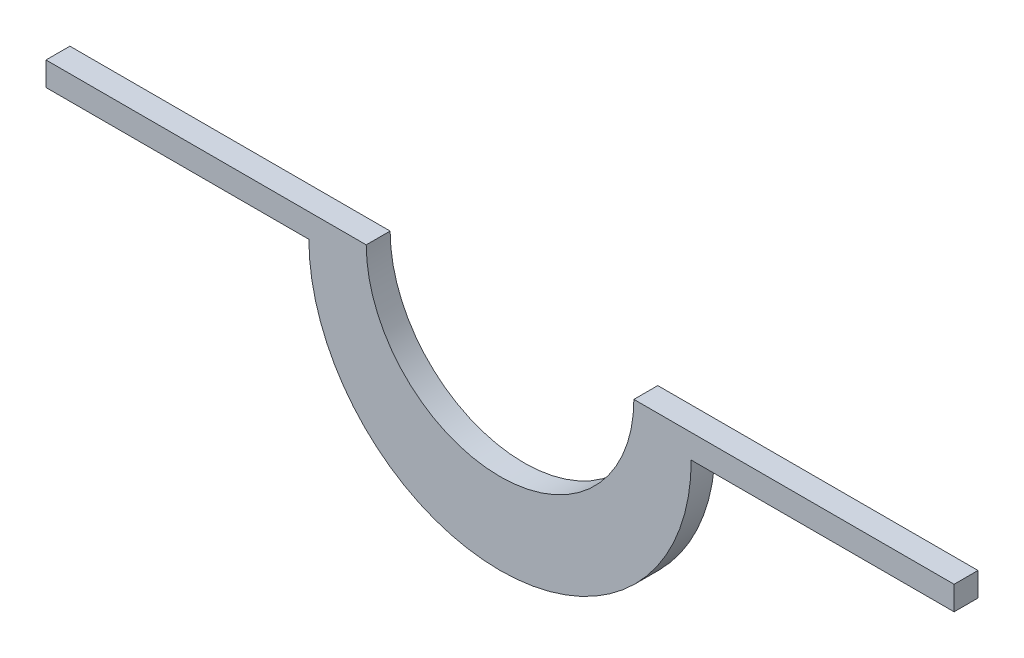
ISO-10303-21;
HEADER;
FILE_DESCRIPTION(('STEP AP214'),'2;1');
FILE_NAME('part.step','',(''),(''),'','','');
FILE_SCHEMA(('AUTOMOTIVE_DESIGN { 1 0 10303 214 1 1 1 1 }'));
ENDSEC;
DATA;
#1=APPLICATION_CONTEXT('core data for automotive mechanical design processes');
#2=APPLICATION_PROTOCOL_DEFINITION('international standard','automotive_design',2000,#1);
#3=PRODUCT_CONTEXT('',#1,'mechanical');
#4=PRODUCT('Part','Part','',(#3));
#5=PRODUCT_RELATED_PRODUCT_CATEGORY('part','',(#4));
#6=PRODUCT_DEFINITION_FORMATION('','',#4);
#7=PRODUCT_DEFINITION_CONTEXT('part definition',#1,'design');
#8=PRODUCT_DEFINITION('design','',#6,#7);
#9=PRODUCT_DEFINITION_SHAPE('','',#8);
#10=(LENGTH_UNIT() NAMED_UNIT(*) SI_UNIT(.MILLI.,.METRE.));
#11=(NAMED_UNIT(*) PLANE_ANGLE_UNIT() SI_UNIT($,.RADIAN.));
#12=(NAMED_UNIT(*) SI_UNIT($,.STERADIAN.) SOLID_ANGLE_UNIT());
#13=UNCERTAINTY_MEASURE_WITH_UNIT(LENGTH_MEASURE(1.E-05),#10,'distance_accuracy_value','');
#14=(GEOMETRIC_REPRESENTATION_CONTEXT(3) GLOBAL_UNCERTAINTY_ASSIGNED_CONTEXT((#13)) GLOBAL_UNIT_ASSIGNED_CONTEXT((#10,
#11,#12)) REPRESENTATION_CONTEXT('',''));
#15=CARTESIAN_POINT('',(0.,0.,0.));
#16=DIRECTION('',(0.,0.,1.));
#17=DIRECTION('',(1.,0.,0.));
#18=AXIS2_PLACEMENT_3D('',#15,#16,#17);
#19=CARTESIAN_POINT('',(190.,-10.,10.));
#20=DIRECTION('',(0.,0.,-1.));
#21=DIRECTION('',(-1.,0.,0.));
#22=AXIS2_PLACEMENT_3D('',#19,#20,#21);
#23=CYLINDRICAL_SURFACE('',#22,80.);
#24=CARTESIAN_POINT('',(190.,-10.,0.));
#25=DIRECTION('',(0.,0.,-1.));
#26=DIRECTION('',(-1.,0.,0.));
#27=AXIS2_PLACEMENT_3D('',#24,#25,#26);
#28=CIRCLE('',#27,80.);
#29=CARTESIAN_POINT('',(270.,-10.,0.));
#30=VERTEX_POINT('',#29);
#31=CARTESIAN_POINT('',(110.,-10.,0.));
#32=VERTEX_POINT('',#31);
#33=EDGE_CURVE('E130',#30,#32,#28,.T.);
#34=ORIENTED_EDGE('',*,*,#33,.F.);
#35=DIRECTION('',(0.,0.,-1.));
#36=VECTOR('',#35,1.);
#37=CARTESIAN_POINT('',(270.,-10.,10.));
#38=LINE('',#37,#36);
#39=CARTESIAN_POINT('',(270.,-10.,10.));
#40=VERTEX_POINT('',#39);
#41=EDGE_CURVE('E11',#40,#30,#38,.T.);
#42=ORIENTED_EDGE('',*,*,#41,.F.);
#43=CARTESIAN_POINT('',(190.,-10.,10.));
#44=DIRECTION('',(0.,0.,-1.));
#45=DIRECTION('',(-1.,0.,0.));
#46=AXIS2_PLACEMENT_3D('',#43,#44,#45);
#47=CIRCLE('',#46,80.);
#48=CARTESIAN_POINT('',(110.,-10.,10.));
#49=VERTEX_POINT('',#48);
#50=EDGE_CURVE('E150',#40,#49,#47,.T.);
#51=ORIENTED_EDGE('',*,*,#50,.T.);
#52=DIRECTION('',(0.,0.,-1.));
#53=VECTOR('',#52,1.);
#54=CARTESIAN_POINT('',(110.,-10.,10.));
#55=LINE('',#54,#53);
#56=EDGE_CURVE('E36',#49,#32,#55,.T.);
#57=ORIENTED_EDGE('',*,*,#56,.T.);
#58=EDGE_LOOP('',(#34,#42,#51,#57));
#59=FACE_BOUND('',#58,.T.);
#60=ADVANCED_FACE('F33',(#59),#23,.T.);
#61=CARTESIAN_POINT('',(380.,-10.,10.));
#62=DIRECTION('',(0.,-1.,0.));
#63=DIRECTION('',(0.,0.,-1.));
#64=AXIS2_PLACEMENT_3D('',#61,#62,#63);
#65=PLANE('',#64);
#66=DIRECTION('',(-1.,0.,0.));
#67=VECTOR('',#66,1.);
#68=CARTESIAN_POINT('',(380.,-10.,0.));
#69=LINE('',#68,#67);
#70=CARTESIAN_POINT('',(380.,-10.,0.));
#71=VERTEX_POINT('',#70);
#72=EDGE_CURVE('E148',#71,#30,#69,.T.);
#73=ORIENTED_EDGE('',*,*,#72,.F.);
#74=DIRECTION('',(0.,0.,-1.));
#75=VECTOR('',#74,1.);
#76=CARTESIAN_POINT('',(380.,-10.,10.));
#77=LINE('',#76,#75);
#78=CARTESIAN_POINT('',(380.,-10.,10.));
#79=VERTEX_POINT('',#78);
#80=EDGE_CURVE('E42',#79,#71,#77,.T.);
#81=ORIENTED_EDGE('',*,*,#80,.F.);
#82=DIRECTION('',(-1.,0.,0.));
#83=VECTOR('',#82,1.);
#84=CARTESIAN_POINT('',(380.,-10.,10.));
#85=LINE('',#84,#83);
#86=EDGE_CURVE('E120',#79,#40,#85,.T.);
#87=ORIENTED_EDGE('',*,*,#86,.T.);
#88=ORIENTED_EDGE('',*,*,#41,.T.);
#89=EDGE_LOOP('',(#73,#81,#87,#88));
#90=FACE_BOUND('',#89,.T.);
#91=ADVANCED_FACE('F162',(#90),#65,.T.);
#92=CARTESIAN_POINT('',(380.,0.,10.));
#93=DIRECTION('',(1.,0.,0.));
#94=DIRECTION('',(0.,0.,-1.));
#95=AXIS2_PLACEMENT_3D('',#92,#93,#94);
#96=PLANE('',#95);
#97=DIRECTION('',(0.,-1.,0.));
#98=VECTOR('',#97,1.);
#99=CARTESIAN_POINT('',(380.,0.,0.));
#100=LINE('',#99,#98);
#101=CARTESIAN_POINT('',(380.,0.,0.));
#102=VERTEX_POINT('',#101);
#103=EDGE_CURVE('E107',#102,#71,#100,.T.);
#104=ORIENTED_EDGE('',*,*,#103,.F.);
#105=DIRECTION('',(0.,0.,-1.));
#106=VECTOR('',#105,1.);
#107=CARTESIAN_POINT('',(380.,0.,10.));
#108=LINE('',#107,#106);
#109=CARTESIAN_POINT('',(380.,0.,10.));
#110=VERTEX_POINT('',#109);
#111=EDGE_CURVE('E102',#110,#102,#108,.T.);
#112=ORIENTED_EDGE('',*,*,#111,.F.);
#113=DIRECTION('',(0.,-1.,0.));
#114=VECTOR('',#113,1.);
#115=CARTESIAN_POINT('',(380.,0.,10.));
#116=LINE('',#115,#114);
#117=EDGE_CURVE('E105',#110,#79,#116,.T.);
#118=ORIENTED_EDGE('',*,*,#117,.T.);
#119=ORIENTED_EDGE('',*,*,#80,.T.);
#120=EDGE_LOOP('',(#104,#112,#118,#119));
#121=FACE_BOUND('',#120,.T.);
#122=ADVANCED_FACE('F104',(#121),#96,.T.);
#123=CARTESIAN_POINT('',(246.,0.,10.));
#124=DIRECTION('',(0.,1.,0.));
#125=DIRECTION('',(-1.,0.,0.));
#126=AXIS2_PLACEMENT_3D('',#123,#124,#125);
#127=PLANE('',#126);
#128=DIRECTION('',(1.,0.,0.));
#129=VECTOR('',#128,1.);
#130=CARTESIAN_POINT('',(246.,0.,0.));
#131=LINE('',#130,#129);
#132=CARTESIAN_POINT('',(246.,0.,0.));
#133=VERTEX_POINT('',#132);
#134=EDGE_CURVE('E145',#133,#102,#131,.T.);
#135=ORIENTED_EDGE('',*,*,#134,.F.);
#136=DIRECTION('',(0.,0.,-1.));
#137=VECTOR('',#136,1.);
#138=CARTESIAN_POINT('',(246.,0.,10.));
#139=LINE('',#138,#137);
#140=CARTESIAN_POINT('',(246.,0.,10.));
#141=VERTEX_POINT('',#140);
#142=EDGE_CURVE('E112',#141,#133,#139,.T.);
#143=ORIENTED_EDGE('',*,*,#142,.F.);
#144=DIRECTION('',(1.,0.,0.));
#145=VECTOR('',#144,1.);
#146=CARTESIAN_POINT('',(246.,0.,10.));
#147=LINE('',#146,#145);
#148=EDGE_CURVE('E118',#141,#110,#147,.T.);
#149=ORIENTED_EDGE('',*,*,#148,.T.);
#150=ORIENTED_EDGE('',*,*,#111,.T.);
#151=EDGE_LOOP('',(#135,#143,#149,#150));
#152=FACE_BOUND('',#151,.T.);
#153=ADVANCED_FACE('F122',(#152),#127,.T.);
#154=CARTESIAN_POINT('',(190.,0.,10.));
#155=DIRECTION('',(0.,0.,-1.));
#156=DIRECTION('',(-1.,0.,0.));
#157=AXIS2_PLACEMENT_3D('',#154,#155,#156);
#158=CYLINDRICAL_SURFACE('',#157,56.);
#159=CARTESIAN_POINT('',(190.,0.,0.));
#160=DIRECTION('',(0.,0.,1.));
#161=DIRECTION('',(1.,0.,0.));
#162=AXIS2_PLACEMENT_3D('',#159,#160,#161);
#163=CIRCLE('',#162,56.);
#164=CARTESIAN_POINT('',(134.,0.,0.));
#165=VERTEX_POINT('',#164);
#166=EDGE_CURVE('E142',#165,#133,#163,.T.);
#167=ORIENTED_EDGE('',*,*,#166,.F.);
#168=DIRECTION('',(0.,0.,-1.));
#169=VECTOR('',#168,1.);
#170=CARTESIAN_POINT('',(134.,0.,10.));
#171=LINE('',#170,#169);
#172=CARTESIAN_POINT('',(134.,0.,10.));
#173=VERTEX_POINT('',#172);
#174=EDGE_CURVE('E154',#173,#165,#171,.T.);
#175=ORIENTED_EDGE('',*,*,#174,.F.);
#176=CARTESIAN_POINT('',(190.,0.,10.));
#177=DIRECTION('',(0.,0.,1.));
#178=DIRECTION('',(1.,0.,0.));
#179=AXIS2_PLACEMENT_3D('',#176,#177,#178);
#180=CIRCLE('',#179,56.);
#181=EDGE_CURVE('E123',#173,#141,#180,.T.);
#182=ORIENTED_EDGE('',*,*,#181,.T.);
#183=ORIENTED_EDGE('',*,*,#142,.T.);
#184=EDGE_LOOP('',(#167,#175,#182,#183));
#185=FACE_BOUND('',#184,.T.);
#186=ADVANCED_FACE('F175',(#185),#158,.F.);
#187=CARTESIAN_POINT('',(0.,0.,10.));
#188=DIRECTION('',(0.,1.,0.));
#189=DIRECTION('',(0.,0.,1.));
#190=AXIS2_PLACEMENT_3D('',#187,#188,#189);
#191=PLANE('',#190);
#192=DIRECTION('',(1.,0.,0.));
#193=VECTOR('',#192,1.);
#194=CARTESIAN_POINT('',(0.,0.,0.));
#195=LINE('',#194,#193);
#196=CARTESIAN_POINT('',(0.,0.,0.));
#197=VERTEX_POINT('',#196);
#198=EDGE_CURVE('E139',#197,#165,#195,.T.);
#199=ORIENTED_EDGE('',*,*,#198,.F.);
#200=DIRECTION('',(0.,0.,-1.));
#201=VECTOR('',#200,1.);
#202=CARTESIAN_POINT('',(0.,0.,10.));
#203=LINE('',#202,#201);
#204=CARTESIAN_POINT('',(0.,0.,10.));
#205=VERTEX_POINT('',#204);
#206=EDGE_CURVE('E156',#205,#197,#203,.T.);
#207=ORIENTED_EDGE('',*,*,#206,.F.);
#208=DIRECTION('',(1.,0.,0.));
#209=VECTOR('',#208,1.);
#210=CARTESIAN_POINT('',(0.,0.,10.));
#211=LINE('',#210,#209);
#212=EDGE_CURVE('E125',#205,#173,#211,.T.);
#213=ORIENTED_EDGE('',*,*,#212,.T.);
#214=ORIENTED_EDGE('',*,*,#174,.T.);
#215=EDGE_LOOP('',(#199,#207,#213,#214));
#216=FACE_BOUND('',#215,.T.);
#217=ADVANCED_FACE('F178',(#216),#191,.T.);
#218=CARTESIAN_POINT('',(0.,-10.,10.));
#219=DIRECTION('',(-1.,0.,0.));
#220=DIRECTION('',(0.,0.,1.));
#221=AXIS2_PLACEMENT_3D('',#218,#219,#220);
#222=PLANE('',#221);
#223=DIRECTION('',(0.,1.,0.));
#224=VECTOR('',#223,1.);
#225=CARTESIAN_POINT('',(0.,-10.,0.));
#226=LINE('',#225,#224);
#227=CARTESIAN_POINT('',(0.,-10.,0.));
#228=VERTEX_POINT('',#227);
#229=EDGE_CURVE('E136',#228,#197,#226,.T.);
#230=ORIENTED_EDGE('',*,*,#229,.F.);
#231=DIRECTION('',(0.,0.,-1.));
#232=VECTOR('',#231,1.);
#233=CARTESIAN_POINT('',(0.,-10.,10.));
#234=LINE('',#233,#232);
#235=CARTESIAN_POINT('',(0.,-10.,10.));
#236=VERTEX_POINT('',#235);
#237=EDGE_CURVE('E157',#236,#228,#234,.T.);
#238=ORIENTED_EDGE('',*,*,#237,.F.);
#239=DIRECTION('',(0.,1.,0.));
#240=VECTOR('',#239,1.);
#241=CARTESIAN_POINT('',(0.,-10.,10.));
#242=LINE('',#241,#240);
#243=EDGE_CURVE('E253',#236,#205,#242,.T.);
#244=ORIENTED_EDGE('',*,*,#243,.T.);
#245=ORIENTED_EDGE('',*,*,#206,.T.);
#246=EDGE_LOOP('',(#230,#238,#244,#245));
#247=FACE_BOUND('',#246,.T.);
#248=ADVANCED_FACE('F182',(#247),#222,.T.);
#249=CARTESIAN_POINT('',(110.,-10.,10.));
#250=DIRECTION('',(0.,-1.,0.));
#251=DIRECTION('',(1.,0.,0.));
#252=AXIS2_PLACEMENT_3D('',#249,#250,#251);
#253=PLANE('',#252);
#254=DIRECTION('',(-1.,0.,0.));
#255=VECTOR('',#254,1.);
#256=CARTESIAN_POINT('',(110.,-10.,0.));
#257=LINE('',#256,#255);
#258=EDGE_CURVE('E133',#32,#228,#257,.T.);
#259=ORIENTED_EDGE('',*,*,#258,.F.);
#260=ORIENTED_EDGE('',*,*,#56,.F.);
#261=DIRECTION('',(-1.,0.,0.));
#262=VECTOR('',#261,1.);
#263=CARTESIAN_POINT('',(110.,-10.,10.));
#264=LINE('',#263,#262);
#265=EDGE_CURVE('E254',#49,#236,#264,.T.);
#266=ORIENTED_EDGE('',*,*,#265,.T.);
#267=ORIENTED_EDGE('',*,*,#237,.T.);
#268=EDGE_LOOP('',(#259,#260,#266,#267));
#269=FACE_BOUND('',#268,.T.);
#270=ADVANCED_FACE('F159',(#269),#253,.T.);
#271=CARTESIAN_POINT('',(190.,-10.,10.));
#272=DIRECTION('',(0.,0.,-1.));
#273=DIRECTION('',(-1.,0.,0.));
#274=AXIS2_PLACEMENT_3D('',#271,#272,#273);
#275=PLANE('',#274);
#276=ORIENTED_EDGE('',*,*,#50,.F.);
#277=ORIENTED_EDGE('',*,*,#86,.F.);
#278=ORIENTED_EDGE('',*,*,#117,.F.);
#279=ORIENTED_EDGE('',*,*,#148,.F.);
#280=ORIENTED_EDGE('',*,*,#181,.F.);
#281=ORIENTED_EDGE('',*,*,#212,.F.);
#282=ORIENTED_EDGE('',*,*,#243,.F.);
#283=ORIENTED_EDGE('',*,*,#265,.F.);
#284=EDGE_LOOP('',(#276,#277,#278,#279,#280,#281,#282,#283));
#285=FACE_BOUND('',#284,.T.);
#286=ADVANCED_FACE('F116',(#285),#275,.F.);
#287=CARTESIAN_POINT('',(190.,-10.,0.));
#288=DIRECTION('',(0.,0.,-1.));
#289=DIRECTION('',(-1.,0.,0.));
#290=AXIS2_PLACEMENT_3D('',#287,#288,#289);
#291=PLANE('',#290);
#292=ORIENTED_EDGE('',*,*,#33,.T.);
#293=ORIENTED_EDGE('',*,*,#258,.T.);
#294=ORIENTED_EDGE('',*,*,#229,.T.);
#295=ORIENTED_EDGE('',*,*,#198,.T.);
#296=ORIENTED_EDGE('',*,*,#166,.T.);
#297=ORIENTED_EDGE('',*,*,#134,.T.);
#298=ORIENTED_EDGE('',*,*,#103,.T.);
#299=ORIENTED_EDGE('',*,*,#72,.T.);
#300=EDGE_LOOP('',(#292,#293,#294,#295,#296,#297,#298,#299));
#301=FACE_BOUND('',#300,.T.);
#302=ADVANCED_FACE('F161',(#301),#291,.T.);
#303=CLOSED_SHELL('',(#60,#91,#122,#153,#186,#217,#248,#270,#286,#302));
#304=MANIFOLD_SOLID_BREP('B2',#303);
#305=ADVANCED_BREP_SHAPE_REPRESENTATION('',(#18,#304),#14);
#306=SHAPE_DEFINITION_REPRESENTATION(#9,#305);
ENDSEC;
END-ISO-10303-21;
